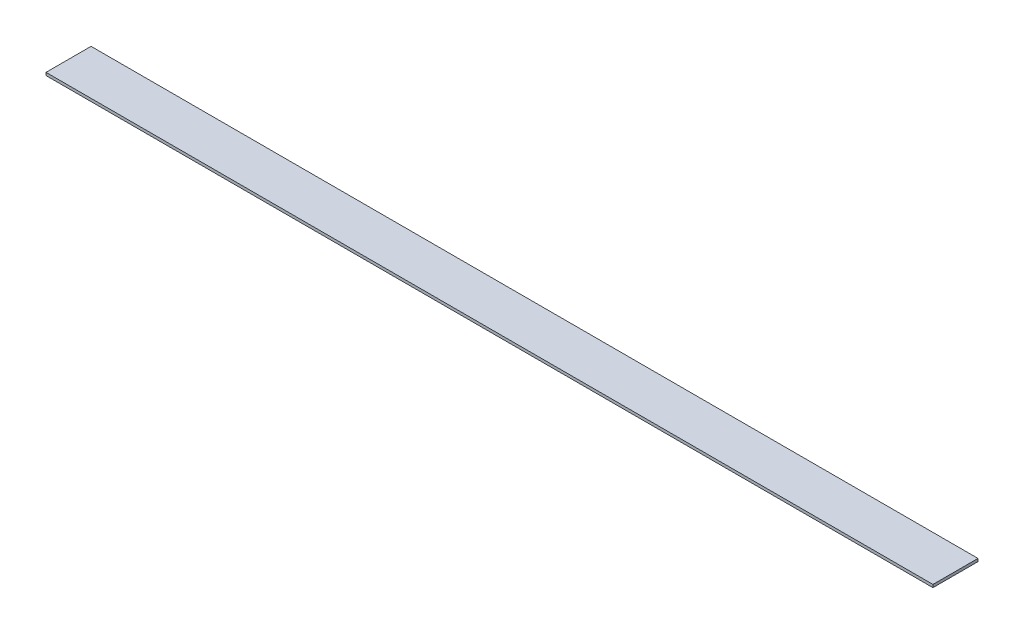
ISO-10303-21;
HEADER;
FILE_DESCRIPTION(('STEP AP214'),'2;1');
FILE_NAME('part.step','',(''),(''),'','','');
FILE_SCHEMA(('AUTOMOTIVE_DESIGN { 1 0 10303 214 1 1 1 1 }'));
ENDSEC;
DATA;
#1=APPLICATION_CONTEXT('core data for automotive mechanical design processes');
#2=APPLICATION_PROTOCOL_DEFINITION('international standard','automotive_design',2000,#1);
#3=PRODUCT_CONTEXT('',#1,'mechanical');
#4=PRODUCT('Part','Part','',(#3));
#5=PRODUCT_RELATED_PRODUCT_CATEGORY('part','',(#4));
#6=PRODUCT_DEFINITION_FORMATION('','',#4);
#7=PRODUCT_DEFINITION_CONTEXT('part definition',#1,'design');
#8=PRODUCT_DEFINITION('design','',#6,#7);
#9=PRODUCT_DEFINITION_SHAPE('','',#8);
#10=(LENGTH_UNIT() NAMED_UNIT(*) SI_UNIT(.MILLI.,.METRE.));
#11=(NAMED_UNIT(*) PLANE_ANGLE_UNIT() SI_UNIT($,.RADIAN.));
#12=(NAMED_UNIT(*) SI_UNIT($,.STERADIAN.) SOLID_ANGLE_UNIT());
#13=UNCERTAINTY_MEASURE_WITH_UNIT(LENGTH_MEASURE(1.E-05),#10,'distance_accuracy_value','');
#14=(GEOMETRIC_REPRESENTATION_CONTEXT(3) GLOBAL_UNCERTAINTY_ASSIGNED_CONTEXT((#13)) GLOBAL_UNIT_ASSIGNED_CONTEXT((#10,
#11,#12)) REPRESENTATION_CONTEXT('',''));
#15=CARTESIAN_POINT('',(0.,0.,0.));
#16=DIRECTION('',(0.,0.,1.));
#17=DIRECTION('',(1.,0.,0.));
#18=AXIS2_PLACEMENT_3D('',#15,#16,#17);
#19=CARTESIAN_POINT('',(-1000.,-1.5875,25.4));
#20=DIRECTION('',(0.,0.,1.));
#21=DIRECTION('',(1.,0.,0.));
#22=AXIS2_PLACEMENT_3D('',#19,#20,#21);
#23=PLANE('',#22);
#24=DIRECTION('',(0.,-1.,0.));
#25=VECTOR('',#24,1.);
#26=CARTESIAN_POINT('',(0.,-1.5875,25.4));
#27=LINE('',#26,#25);
#28=CARTESIAN_POINT('',(0.,1.5875,25.4));
#29=VERTEX_POINT('',#28);
#30=CARTESIAN_POINT('',(0.,-1.5875,25.4));
#31=VERTEX_POINT('',#30);
#32=EDGE_CURVE('E103',#29,#31,#27,.T.);
#33=ORIENTED_EDGE('',*,*,#32,.F.);
#34=DIRECTION('',(1.,0.,0.));
#35=VECTOR('',#34,1.);
#36=CARTESIAN_POINT('',(-1000.,1.5875,25.4));
#37=LINE('',#36,#35);
#38=CARTESIAN_POINT('',(-1000.,1.5875,25.4));
#39=VERTEX_POINT('',#38);
#40=EDGE_CURVE('E11',#39,#29,#37,.T.);
#41=ORIENTED_EDGE('',*,*,#40,.F.);
#42=DIRECTION('',(0.,-1.,0.));
#43=VECTOR('',#42,1.);
#44=CARTESIAN_POINT('',(-1000.,-1.5875,25.4));
#45=LINE('',#44,#43);
#46=CARTESIAN_POINT('',(-1000.,-1.5875,25.4));
#47=VERTEX_POINT('',#46);
#48=EDGE_CURVE('E97',#39,#47,#45,.T.);
#49=ORIENTED_EDGE('',*,*,#48,.T.);
#50=DIRECTION('',(1.,0.,0.));
#51=VECTOR('',#50,1.);
#52=CARTESIAN_POINT('',(-1000.,-1.5875,25.4));
#53=LINE('',#52,#51);
#54=EDGE_CURVE('E42',#47,#31,#53,.T.);
#55=ORIENTED_EDGE('',*,*,#54,.T.);
#56=EDGE_LOOP('',(#33,#41,#49,#55));
#57=FACE_BOUND('',#56,.T.);
#58=ADVANCED_FACE('F39',(#57),#23,.T.);
#59=CARTESIAN_POINT('',(-1000.,1.58750000000001,-25.4));
#60=DIRECTION('',(0.,1.,0.));
#61=DIRECTION('',(0.,0.,1.));
#62=AXIS2_PLACEMENT_3D('',#59,#60,#61);
#63=PLANE('',#62);
#64=DIRECTION('',(0.,0.,1.));
#65=VECTOR('',#64,1.);
#66=CARTESIAN_POINT('',(0.,1.58750000000001,-25.4));
#67=LINE('',#66,#65);
#68=CARTESIAN_POINT('',(0.,1.58750000000001,-25.4));
#69=VERTEX_POINT('',#68);
#70=EDGE_CURVE('E99',#69,#29,#67,.T.);
#71=ORIENTED_EDGE('',*,*,#70,.F.);
#72=DIRECTION('',(1.,0.,0.));
#73=VECTOR('',#72,1.);
#74=CARTESIAN_POINT('',(-1000.,1.58750000000001,-25.4));
#75=LINE('',#74,#73);
#76=CARTESIAN_POINT('',(-1000.,1.58750000000001,-25.4));
#77=VERTEX_POINT('',#76);
#78=EDGE_CURVE('E48',#77,#69,#75,.T.);
#79=ORIENTED_EDGE('',*,*,#78,.F.);
#80=DIRECTION('',(0.,0.,1.));
#81=VECTOR('',#80,1.);
#82=CARTESIAN_POINT('',(-1000.,1.58750000000001,-25.4));
#83=LINE('',#82,#81);
#84=EDGE_CURVE('E94',#77,#39,#83,.T.);
#85=ORIENTED_EDGE('',*,*,#84,.T.);
#86=ORIENTED_EDGE('',*,*,#40,.T.);
#87=EDGE_LOOP('',(#71,#79,#85,#86));
#88=FACE_BOUND('',#87,.T.);
#89=ADVANCED_FACE('F113',(#88),#63,.T.);
#90=CARTESIAN_POINT('',(-1000.,-1.58749999999999,-25.4));
#91=DIRECTION('',(0.,0.,-1.));
#92=DIRECTION('',(-1.,0.,0.));
#93=AXIS2_PLACEMENT_3D('',#90,#91,#92);
#94=PLANE('',#93);
#95=DIRECTION('',(0.,1.,0.));
#96=VECTOR('',#95,1.);
#97=CARTESIAN_POINT('',(0.,-1.58749999999999,-25.4));
#98=LINE('',#97,#96);
#99=CARTESIAN_POINT('',(0.,-1.58749999999999,-25.4));
#100=VERTEX_POINT('',#99);
#101=EDGE_CURVE('E89',#100,#69,#98,.T.);
#102=ORIENTED_EDGE('',*,*,#101,.F.);
#103=DIRECTION('',(1.,0.,0.));
#104=VECTOR('',#103,1.);
#105=CARTESIAN_POINT('',(-1000.,-1.58749999999999,-25.4));
#106=LINE('',#105,#104);
#107=CARTESIAN_POINT('',(-1000.,-1.58749999999999,-25.4));
#108=VERTEX_POINT('',#107);
#109=EDGE_CURVE('E84',#108,#100,#106,.T.);
#110=ORIENTED_EDGE('',*,*,#109,.F.);
#111=DIRECTION('',(0.,1.,0.));
#112=VECTOR('',#111,1.);
#113=CARTESIAN_POINT('',(-1000.,-1.58749999999999,-25.4));
#114=LINE('',#113,#112);
#115=EDGE_CURVE('E87',#108,#77,#114,.T.);
#116=ORIENTED_EDGE('',*,*,#115,.T.);
#117=ORIENTED_EDGE('',*,*,#78,.T.);
#118=EDGE_LOOP('',(#102,#110,#116,#117));
#119=FACE_BOUND('',#118,.T.);
#120=ADVANCED_FACE('F86',(#119),#94,.T.);
#121=CARTESIAN_POINT('',(-1000.,-1.58749999999999,-25.4));
#122=DIRECTION('',(0.,-1.,0.));
#123=DIRECTION('',(0.,0.,-1.));
#124=AXIS2_PLACEMENT_3D('',#121,#122,#123);
#125=PLANE('',#124);
#126=DIRECTION('',(0.,0.,-1.));
#127=VECTOR('',#126,1.);
#128=CARTESIAN_POINT('',(0.,-1.58749999999999,-25.4));
#129=LINE('',#128,#127);
#130=EDGE_CURVE('E106',#31,#100,#129,.T.);
#131=ORIENTED_EDGE('',*,*,#130,.F.);
#132=ORIENTED_EDGE('',*,*,#54,.F.);
#133=DIRECTION('',(0.,0.,-1.));
#134=VECTOR('',#133,1.);
#135=CARTESIAN_POINT('',(-1000.,-1.58749999999999,-25.4));
#136=LINE('',#135,#134);
#137=EDGE_CURVE('E93',#47,#108,#136,.T.);
#138=ORIENTED_EDGE('',*,*,#137,.T.);
#139=ORIENTED_EDGE('',*,*,#109,.T.);
#140=EDGE_LOOP('',(#131,#132,#138,#139));
#141=FACE_BOUND('',#140,.T.);
#142=ADVANCED_FACE('F96',(#141),#125,.T.);
#143=CARTESIAN_POINT('',(-1000.,0.,0.));
#144=DIRECTION('',(1.,0.,0.));
#145=DIRECTION('',(0.,0.,-1.));
#146=AXIS2_PLACEMENT_3D('',#143,#144,#145);
#147=PLANE('',#146);
#148=ORIENTED_EDGE('',*,*,#48,.F.);
#149=ORIENTED_EDGE('',*,*,#84,.F.);
#150=ORIENTED_EDGE('',*,*,#115,.F.);
#151=ORIENTED_EDGE('',*,*,#137,.F.);
#152=EDGE_LOOP('',(#148,#149,#150,#151));
#153=FACE_BOUND('',#152,.T.);
#154=ADVANCED_FACE('F92',(#153),#147,.F.);
#155=CARTESIAN_POINT('',(0.,0.,0.));
#156=DIRECTION('',(1.,0.,0.));
#157=DIRECTION('',(0.,0.,-1.));
#158=AXIS2_PLACEMENT_3D('',#155,#156,#157);
#159=PLANE('',#158);
#160=ORIENTED_EDGE('',*,*,#32,.T.);
#161=ORIENTED_EDGE('',*,*,#130,.T.);
#162=ORIENTED_EDGE('',*,*,#101,.T.);
#163=ORIENTED_EDGE('',*,*,#70,.T.);
#164=EDGE_LOOP('',(#160,#161,#162,#163));
#165=FACE_BOUND('',#164,.T.);
#166=ADVANCED_FACE('F112',(#165),#159,.T.);
#167=CLOSED_SHELL('',(#58,#89,#120,#142,#154,#166));
#168=MANIFOLD_SOLID_BREP('B2',#167);
#169=ADVANCED_BREP_SHAPE_REPRESENTATION('',(#18,#168),#14);
#170=SHAPE_DEFINITION_REPRESENTATION(#9,#169);
ENDSEC;
END-ISO-10303-21;
